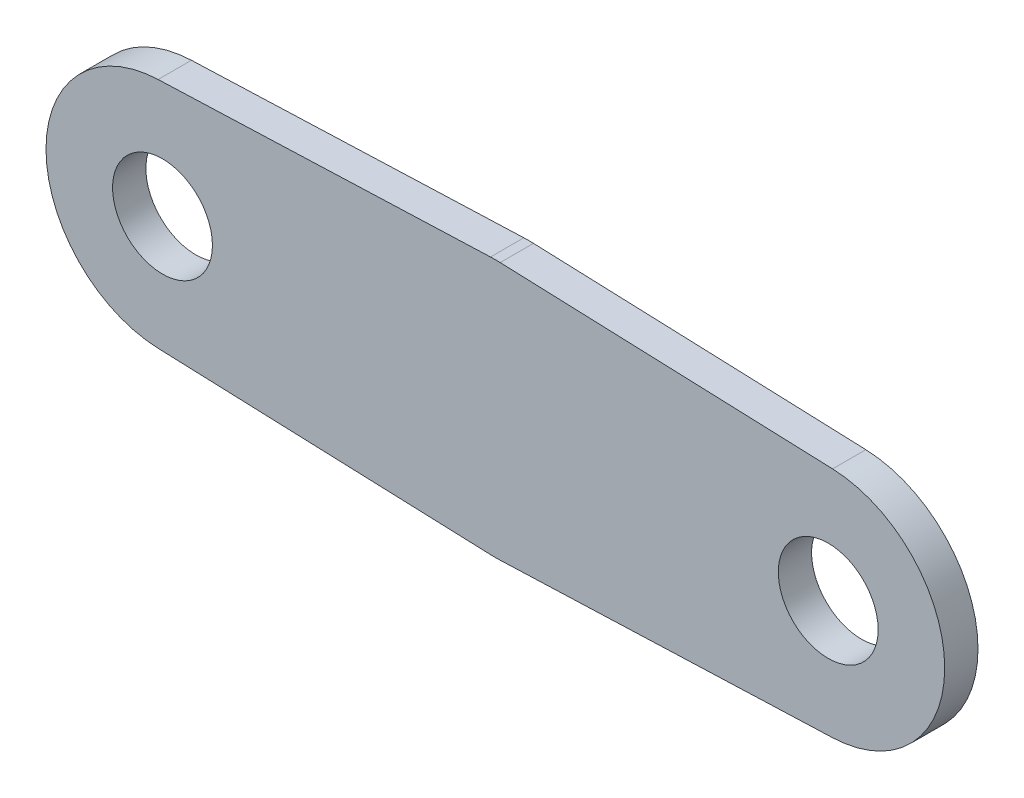
ISO-10303-21;
HEADER;
FILE_DESCRIPTION(('STEP AP214'),'2;1');
FILE_NAME('part.step','',(''),(''),'','','');
FILE_SCHEMA(('AUTOMOTIVE_DESIGN { 1 0 10303 214 1 1 1 1 }'));
ENDSEC;
DATA;
#1=APPLICATION_CONTEXT('core data for automotive mechanical design processes');
#2=APPLICATION_PROTOCOL_DEFINITION('international standard','automotive_design',2000,#1);
#3=PRODUCT_CONTEXT('',#1,'mechanical');
#4=PRODUCT('Part','Part','',(#3));
#5=PRODUCT_RELATED_PRODUCT_CATEGORY('part','',(#4));
#6=PRODUCT_DEFINITION_FORMATION('','',#4);
#7=PRODUCT_DEFINITION_CONTEXT('part definition',#1,'design');
#8=PRODUCT_DEFINITION('design','',#6,#7);
#9=PRODUCT_DEFINITION_SHAPE('','',#8);
#10=(LENGTH_UNIT() NAMED_UNIT(*) SI_UNIT(.MILLI.,.METRE.));
#11=(NAMED_UNIT(*) PLANE_ANGLE_UNIT() SI_UNIT($,.RADIAN.));
#12=(NAMED_UNIT(*) SI_UNIT($,.STERADIAN.) SOLID_ANGLE_UNIT());
#13=UNCERTAINTY_MEASURE_WITH_UNIT(LENGTH_MEASURE(1.E-05),#10,'distance_accuracy_value','');
#14=(GEOMETRIC_REPRESENTATION_CONTEXT(3) GLOBAL_UNCERTAINTY_ASSIGNED_CONTEXT((#13)) GLOBAL_UNIT_ASSIGNED_CONTEXT((#10,
#11,#12)) REPRESENTATION_CONTEXT('',''));
#15=CARTESIAN_POINT('',(0.,0.,0.));
#16=DIRECTION('',(0.,0.,1.));
#17=DIRECTION('',(1.,0.,0.));
#18=AXIS2_PLACEMENT_3D('',#15,#16,#17);
#19=CARTESIAN_POINT('',(0.,0.,2.));
#20=DIRECTION('',(0.,0.,1.));
#21=DIRECTION('',(1.,0.,0.));
#22=AXIS2_PLACEMENT_3D('',#19,#20,#21);
#23=PLANE('',#22);
#24=CARTESIAN_POINT('',(-20.,0.,2.));
#25=DIRECTION('',(0.,0.,1.));
#26=DIRECTION('',(1.,0.,0.));
#27=AXIS2_PLACEMENT_3D('',#24,#25,#26);
#28=CIRCLE('',#27,3.);
#29=CARTESIAN_POINT('',(-17.,0.,2.));
#30=VERTEX_POINT('',#29);
#31=EDGE_CURVE('E135',#30,#30,#28,.T.);
#32=ORIENTED_EDGE('',*,*,#31,.F.);
#33=EDGE_LOOP('',(#32));
#34=FACE_BOUND('',#33,.T.);
#35=CARTESIAN_POINT('',(0.,0.,2.));
#36=DIRECTION('',(0.,0.,1.));
#37=DIRECTION('',(1.,0.,0.));
#38=AXIS2_PLACEMENT_3D('',#35,#36,#37);
#39=CIRCLE('',#38,7.75);
#40=CARTESIAN_POINT('',(0.290624999999998,7.74454886416084,2.));
#41=VERTEX_POINT('',#40);
#42=CARTESIAN_POINT('',(-0.290625,7.74454886416085,2.));
#43=VERTEX_POINT('',#42);
#44=EDGE_CURVE('E146',#41,#43,#39,.T.);
#45=ORIENTED_EDGE('',*,*,#44,.T.);
#46=DIRECTION('',(-0.999296627633657,-0.0375,0.));
#47=VECTOR('',#46,1.);
#48=CARTESIAN_POINT('',(-0.290625,7.74454886416085,2.));
#49=LINE('',#48,#47);
#50=CARTESIAN_POINT('',(-20.2625,6.9950763934356,2.));
#51=VERTEX_POINT('',#50);
#52=EDGE_CURVE('E94',#43,#51,#49,.T.);
#53=ORIENTED_EDGE('',*,*,#52,.T.);
#54=CARTESIAN_POINT('',(-20.,0.,2.));
#55=DIRECTION('',(0.,0.,1.));
#56=DIRECTION('',(1.,0.,0.));
#57=AXIS2_PLACEMENT_3D('',#54,#55,#56);
#58=CIRCLE('',#57,7.);
#59=CARTESIAN_POINT('',(-20.2625,-6.9950763934356,2.));
#60=VERTEX_POINT('',#59);
#61=EDGE_CURVE('E161',#51,#60,#58,.T.);
#62=ORIENTED_EDGE('',*,*,#61,.T.);
#63=DIRECTION('',(0.999296627633657,-0.0375,0.));
#64=VECTOR('',#63,1.);
#65=CARTESIAN_POINT('',(-0.290625,-7.74454886416085,2.));
#66=LINE('',#65,#64);
#67=CARTESIAN_POINT('',(-0.290625,-7.74454886416085,2.));
#68=VERTEX_POINT('',#67);
#69=EDGE_CURVE('E174',#60,#68,#66,.T.);
#70=ORIENTED_EDGE('',*,*,#69,.T.);
#71=CARTESIAN_POINT('',(0.,0.,2.));
#72=DIRECTION('',(0.,0.,1.));
#73=DIRECTION('',(1.,0.,0.));
#74=AXIS2_PLACEMENT_3D('',#71,#72,#73);
#75=CIRCLE('',#74,7.75);
#76=CARTESIAN_POINT('',(0.290625000000003,-7.74454886416084,2.));
#77=VERTEX_POINT('',#76);
#78=EDGE_CURVE('E113',#68,#77,#75,.T.);
#79=ORIENTED_EDGE('',*,*,#78,.T.);
#80=DIRECTION('',(0.999296627633657,0.0375000000000003,0.));
#81=VECTOR('',#80,1.);
#82=CARTESIAN_POINT('',(0.290625000000002,-7.74454886416084,2.));
#83=LINE('',#82,#81);
#84=CARTESIAN_POINT('',(20.2625,-6.99507639343559,2.));
#85=VERTEX_POINT('',#84);
#86=EDGE_CURVE('E107',#77,#85,#83,.T.);
#87=ORIENTED_EDGE('',*,*,#86,.T.);
#88=CARTESIAN_POINT('',(20.,0.,2.));
#89=DIRECTION('',(0.,0.,1.));
#90=DIRECTION('',(1.,0.,0.));
#91=AXIS2_PLACEMENT_3D('',#88,#89,#90);
#92=CIRCLE('',#91,7.);
#93=CARTESIAN_POINT('',(20.2625,6.99507639343561,2.));
#94=VERTEX_POINT('',#93);
#95=EDGE_CURVE('E111',#85,#94,#92,.T.);
#96=ORIENTED_EDGE('',*,*,#95,.T.);
#97=DIRECTION('',(-0.999296627633657,0.0374999999999998,0.));
#98=VECTOR('',#97,1.);
#99=CARTESIAN_POINT('',(0.290624999999998,7.74454886416084,2.));
#100=LINE('',#99,#98);
#101=EDGE_CURVE('E51',#94,#41,#100,.T.);
#102=ORIENTED_EDGE('',*,*,#101,.T.);
#103=EDGE_LOOP('',(#45,#53,#62,#70,#79,#87,#96,#102));
#104=FACE_BOUND('',#103,.T.);
#105=CARTESIAN_POINT('',(20.,0.,2.));
#106=DIRECTION('',(0.,0.,1.));
#107=DIRECTION('',(1.,0.,0.));
#108=AXIS2_PLACEMENT_3D('',#105,#106,#107);
#109=CIRCLE('',#108,3.);
#110=CARTESIAN_POINT('',(23.,0.,2.));
#111=VERTEX_POINT('',#110);
#112=EDGE_CURVE('E183',#111,#111,#109,.T.);
#113=ORIENTED_EDGE('',*,*,#112,.F.);
#114=EDGE_LOOP('',(#113));
#115=FACE_BOUND('',#114,.T.);
#116=ADVANCED_FACE('F34',(#34,#104,#115),#23,.T.);
#117=CARTESIAN_POINT('',(0.,0.,0.));
#118=DIRECTION('',(0.,0.,1.));
#119=DIRECTION('',(1.,0.,0.));
#120=AXIS2_PLACEMENT_3D('',#117,#118,#119);
#121=PLANE('',#120);
#122=CARTESIAN_POINT('',(0.,0.,0.));
#123=DIRECTION('',(0.,0.,1.));
#124=DIRECTION('',(1.,0.,0.));
#125=AXIS2_PLACEMENT_3D('',#122,#123,#124);
#126=CIRCLE('',#125,7.75);
#127=CARTESIAN_POINT('',(0.290624999999998,7.74454886416084,0.));
#128=VERTEX_POINT('',#127);
#129=CARTESIAN_POINT('',(-0.290625,7.74454886416085,0.));
#130=VERTEX_POINT('',#129);
#131=EDGE_CURVE('E131',#128,#130,#126,.T.);
#132=ORIENTED_EDGE('',*,*,#131,.F.);
#133=DIRECTION('',(-0.999296627633657,0.0374999999999998,0.));
#134=VECTOR('',#133,1.);
#135=CARTESIAN_POINT('',(0.290624999999998,7.74454886416084,0.));
#136=LINE('',#135,#134);
#137=CARTESIAN_POINT('',(20.2625,6.99507639343561,0.));
#138=VERTEX_POINT('',#137);
#139=EDGE_CURVE('E86',#138,#128,#136,.T.);
#140=ORIENTED_EDGE('',*,*,#139,.F.);
#141=CARTESIAN_POINT('',(20.,0.,0.));
#142=DIRECTION('',(0.,0.,1.));
#143=DIRECTION('',(1.,0.,0.));
#144=AXIS2_PLACEMENT_3D('',#141,#142,#143);
#145=CIRCLE('',#144,7.);
#146=CARTESIAN_POINT('',(20.2625,-6.99507639343559,0.));
#147=VERTEX_POINT('',#146);
#148=EDGE_CURVE('E80',#147,#138,#145,.T.);
#149=ORIENTED_EDGE('',*,*,#148,.F.);
#150=DIRECTION('',(0.999296627633657,0.0375000000000003,0.));
#151=VECTOR('',#150,1.);
#152=CARTESIAN_POINT('',(0.290625000000002,-7.74454886416084,0.));
#153=LINE('',#152,#151);
#154=CARTESIAN_POINT('',(0.290625000000003,-7.74454886416084,0.));
#155=VERTEX_POINT('',#154);
#156=EDGE_CURVE('E121',#155,#147,#153,.T.);
#157=ORIENTED_EDGE('',*,*,#156,.F.);
#158=CARTESIAN_POINT('',(0.,0.,0.));
#159=DIRECTION('',(0.,0.,1.));
#160=DIRECTION('',(1.,0.,0.));
#161=AXIS2_PLACEMENT_3D('',#158,#159,#160);
#162=CIRCLE('',#161,7.75);
#163=CARTESIAN_POINT('',(-0.290625,-7.74454886416085,0.));
#164=VERTEX_POINT('',#163);
#165=EDGE_CURVE('E141',#164,#155,#162,.T.);
#166=ORIENTED_EDGE('',*,*,#165,.F.);
#167=DIRECTION('',(0.999296627633657,-0.0375,0.));
#168=VECTOR('',#167,1.);
#169=CARTESIAN_POINT('',(-0.290625,-7.74454886416085,0.));
#170=LINE('',#169,#168);
#171=CARTESIAN_POINT('',(-20.2625,-6.9950763934356,0.));
#172=VERTEX_POINT('',#171);
#173=EDGE_CURVE('E139',#172,#164,#170,.T.);
#174=ORIENTED_EDGE('',*,*,#173,.F.);
#175=CARTESIAN_POINT('',(-20.,0.,0.));
#176=DIRECTION('',(0.,0.,1.));
#177=DIRECTION('',(1.,0.,0.));
#178=AXIS2_PLACEMENT_3D('',#175,#176,#177);
#179=CIRCLE('',#178,7.);
#180=CARTESIAN_POINT('',(-20.2625,6.9950763934356,0.));
#181=VERTEX_POINT('',#180);
#182=EDGE_CURVE('E137',#181,#172,#179,.T.);
#183=ORIENTED_EDGE('',*,*,#182,.F.);
#184=DIRECTION('',(-0.999296627633657,-0.0375,0.));
#185=VECTOR('',#184,1.);
#186=CARTESIAN_POINT('',(-0.290625,7.74454886416085,0.));
#187=LINE('',#186,#185);
#188=EDGE_CURVE('E134',#130,#181,#187,.T.);
#189=ORIENTED_EDGE('',*,*,#188,.F.);
#190=EDGE_LOOP('',(#132,#140,#149,#157,#166,#174,#183,#189));
#191=FACE_BOUND('',#190,.T.);
#192=CARTESIAN_POINT('',(-20.,0.,0.));
#193=DIRECTION('',(0.,0.,1.));
#194=DIRECTION('',(1.,0.,0.));
#195=AXIS2_PLACEMENT_3D('',#192,#193,#194);
#196=CIRCLE('',#195,3.);
#197=CARTESIAN_POINT('',(-17.,0.,0.));
#198=VERTEX_POINT('',#197);
#199=EDGE_CURVE('E180',#198,#198,#196,.T.);
#200=ORIENTED_EDGE('',*,*,#199,.T.);
#201=EDGE_LOOP('',(#200));
#202=FACE_BOUND('',#201,.T.);
#203=CARTESIAN_POINT('',(20.,0.,0.));
#204=DIRECTION('',(0.,0.,1.));
#205=DIRECTION('',(1.,0.,0.));
#206=AXIS2_PLACEMENT_3D('',#203,#204,#205);
#207=CIRCLE('',#206,3.);
#208=CARTESIAN_POINT('',(23.,0.,0.));
#209=VERTEX_POINT('',#208);
#210=EDGE_CURVE('E186',#209,#209,#207,.T.);
#211=ORIENTED_EDGE('',*,*,#210,.T.);
#212=EDGE_LOOP('',(#211));
#213=FACE_BOUND('',#212,.T.);
#214=ADVANCED_FACE('F165',(#191,#202,#213),#121,.F.);
#215=CARTESIAN_POINT('',(0.,0.,2.));
#216=DIRECTION('',(0.,0.,-1.));
#217=DIRECTION('',(-1.,0.,0.));
#218=AXIS2_PLACEMENT_3D('',#215,#216,#217);
#219=CYLINDRICAL_SURFACE('',#218,7.75);
#220=ORIENTED_EDGE('',*,*,#131,.T.);
#221=DIRECTION('',(0.,0.,-1.));
#222=VECTOR('',#221,1.);
#223=CARTESIAN_POINT('',(-0.290625,7.74454886416085,2.));
#224=LINE('',#223,#222);
#225=EDGE_CURVE('E11',#43,#130,#224,.T.);
#226=ORIENTED_EDGE('',*,*,#225,.F.);
#227=ORIENTED_EDGE('',*,*,#44,.F.);
#228=DIRECTION('',(0.,0.,-1.));
#229=VECTOR('',#228,1.);
#230=CARTESIAN_POINT('',(0.290624999999998,7.74454886416084,2.));
#231=LINE('',#230,#229);
#232=EDGE_CURVE('E127',#41,#128,#231,.T.);
#233=ORIENTED_EDGE('',*,*,#232,.T.);
#234=EDGE_LOOP('',(#220,#226,#227,#233));
#235=FACE_BOUND('',#234,.T.);
#236=ADVANCED_FACE('F36',(#235),#219,.T.);
#237=CARTESIAN_POINT('',(-0.290625,7.74454886416085,2.));
#238=DIRECTION('',(0.0375,-0.999296627633657,0.));
#239=DIRECTION('',(0.999296627633657,0.0375,0.));
#240=AXIS2_PLACEMENT_3D('',#237,#238,#239);
#241=PLANE('',#240);
#242=ORIENTED_EDGE('',*,*,#188,.T.);
#243=DIRECTION('',(0.,0.,-1.));
#244=VECTOR('',#243,1.);
#245=CARTESIAN_POINT('',(-20.2625,6.9950763934356,2.));
#246=LINE('',#245,#244);
#247=EDGE_CURVE('E43',#51,#181,#246,.T.);
#248=ORIENTED_EDGE('',*,*,#247,.F.);
#249=ORIENTED_EDGE('',*,*,#52,.F.);
#250=ORIENTED_EDGE('',*,*,#225,.T.);
#251=EDGE_LOOP('',(#242,#248,#249,#250));
#252=FACE_BOUND('',#251,.T.);
#253=ADVANCED_FACE('F218',(#252),#241,.F.);
#254=CARTESIAN_POINT('',(-20.,0.,2.));
#255=DIRECTION('',(0.,0.,-1.));
#256=DIRECTION('',(-1.,0.,0.));
#257=AXIS2_PLACEMENT_3D('',#254,#255,#256);
#258=CYLINDRICAL_SURFACE('',#257,7.);
#259=ORIENTED_EDGE('',*,*,#182,.T.);
#260=DIRECTION('',(0.,0.,-1.));
#261=VECTOR('',#260,1.);
#262=CARTESIAN_POINT('',(-20.2625,-6.9950763934356,2.));
#263=LINE('',#262,#261);
#264=EDGE_CURVE('E153',#60,#172,#263,.T.);
#265=ORIENTED_EDGE('',*,*,#264,.F.);
#266=ORIENTED_EDGE('',*,*,#61,.F.);
#267=ORIENTED_EDGE('',*,*,#247,.T.);
#268=EDGE_LOOP('',(#259,#265,#266,#267));
#269=FACE_BOUND('',#268,.T.);
#270=ADVANCED_FACE('F159',(#269),#258,.T.);
#271=CARTESIAN_POINT('',(-0.290625,-7.74454886416085,2.));
#272=DIRECTION('',(0.0375,0.999296627633657,0.));
#273=DIRECTION('',(-0.999296627633657,0.0375,0.));
#274=AXIS2_PLACEMENT_3D('',#271,#272,#273);
#275=PLANE('',#274);
#276=ORIENTED_EDGE('',*,*,#173,.T.);
#277=DIRECTION('',(0.,0.,-1.));
#278=VECTOR('',#277,1.);
#279=CARTESIAN_POINT('',(-0.290625,-7.74454886416085,2.));
#280=LINE('',#279,#278);
#281=EDGE_CURVE('E150',#68,#164,#280,.T.);
#282=ORIENTED_EDGE('',*,*,#281,.F.);
#283=ORIENTED_EDGE('',*,*,#69,.F.);
#284=ORIENTED_EDGE('',*,*,#264,.T.);
#285=EDGE_LOOP('',(#276,#282,#283,#284));
#286=FACE_BOUND('',#285,.T.);
#287=ADVANCED_FACE('F170',(#286),#275,.F.);
#288=CARTESIAN_POINT('',(0.,0.,2.));
#289=DIRECTION('',(0.,0.,-1.));
#290=DIRECTION('',(-1.,0.,0.));
#291=AXIS2_PLACEMENT_3D('',#288,#289,#290);
#292=CYLINDRICAL_SURFACE('',#291,7.75);
#293=ORIENTED_EDGE('',*,*,#165,.T.);
#294=DIRECTION('',(0.,0.,-1.));
#295=VECTOR('',#294,1.);
#296=CARTESIAN_POINT('',(0.290625000000003,-7.74454886416084,2.));
#297=LINE('',#296,#295);
#298=EDGE_CURVE('E122',#77,#155,#297,.T.);
#299=ORIENTED_EDGE('',*,*,#298,.F.);
#300=ORIENTED_EDGE('',*,*,#78,.F.);
#301=ORIENTED_EDGE('',*,*,#281,.T.);
#302=EDGE_LOOP('',(#293,#299,#300,#301));
#303=FACE_BOUND('',#302,.T.);
#304=ADVANCED_FACE('F173',(#303),#292,.T.);
#305=CARTESIAN_POINT('',(0.290625000000002,-7.74454886416084,2.));
#306=DIRECTION('',(-0.0375000000000003,0.999296627633657,0.));
#307=DIRECTION('',(-0.999296627633657,-0.0375000000000003,0.));
#308=AXIS2_PLACEMENT_3D('',#305,#306,#307);
#309=PLANE('',#308);
#310=ORIENTED_EDGE('',*,*,#156,.T.);
#311=DIRECTION('',(0.,0.,-1.));
#312=VECTOR('',#311,1.);
#313=CARTESIAN_POINT('',(20.2625,-6.99507639343559,2.));
#314=LINE('',#313,#312);
#315=EDGE_CURVE('E118',#85,#147,#314,.T.);
#316=ORIENTED_EDGE('',*,*,#315,.F.);
#317=ORIENTED_EDGE('',*,*,#86,.F.);
#318=ORIENTED_EDGE('',*,*,#298,.T.);
#319=EDGE_LOOP('',(#310,#316,#317,#318));
#320=FACE_BOUND('',#319,.T.);
#321=ADVANCED_FACE('F119',(#320),#309,.F.);
#322=CARTESIAN_POINT('',(20.,0.,2.));
#323=DIRECTION('',(0.,0.,-1.));
#324=DIRECTION('',(-1.,0.,0.));
#325=AXIS2_PLACEMENT_3D('',#322,#323,#324);
#326=CYLINDRICAL_SURFACE('',#325,7.);
#327=ORIENTED_EDGE('',*,*,#148,.T.);
#328=DIRECTION('',(0.,0.,-1.));
#329=VECTOR('',#328,1.);
#330=CARTESIAN_POINT('',(20.2625,6.99507639343561,2.));
#331=LINE('',#330,#329);
#332=EDGE_CURVE('E123',#94,#138,#331,.T.);
#333=ORIENTED_EDGE('',*,*,#332,.F.);
#334=ORIENTED_EDGE('',*,*,#95,.F.);
#335=ORIENTED_EDGE('',*,*,#315,.T.);
#336=EDGE_LOOP('',(#327,#333,#334,#335));
#337=FACE_BOUND('',#336,.T.);
#338=ADVANCED_FACE('F125',(#337),#326,.T.);
#339=CARTESIAN_POINT('',(0.290624999999998,7.74454886416084,2.));
#340=DIRECTION('',(-0.0374999999999998,-0.999296627633657,0.));
#341=DIRECTION('',(0.999296627633657,-0.0374999999999998,0.));
#342=AXIS2_PLACEMENT_3D('',#339,#340,#341);
#343=PLANE('',#342);
#344=ORIENTED_EDGE('',*,*,#139,.T.);
#345=ORIENTED_EDGE('',*,*,#232,.F.);
#346=ORIENTED_EDGE('',*,*,#101,.F.);
#347=ORIENTED_EDGE('',*,*,#332,.T.);
#348=EDGE_LOOP('',(#344,#345,#346,#347));
#349=FACE_BOUND('',#348,.T.);
#350=ADVANCED_FACE('F206',(#349),#343,.F.);
#351=CARTESIAN_POINT('',(-20.,0.,2.));
#352=DIRECTION('',(0.,0.,-1.));
#353=DIRECTION('',(-1.,0.,0.));
#354=AXIS2_PLACEMENT_3D('',#351,#352,#353);
#355=CYLINDRICAL_SURFACE('',#354,3.);
#356=ORIENTED_EDGE('',*,*,#31,.T.);
#357=EDGE_LOOP('',(#356));
#358=FACE_BOUND('',#357,.T.);
#359=ORIENTED_EDGE('',*,*,#199,.F.);
#360=EDGE_LOOP('',(#359));
#361=FACE_BOUND('',#360,.T.);
#362=ADVANCED_FACE('F203',(#358,#361),#355,.F.);
#363=CARTESIAN_POINT('',(20.,0.,2.));
#364=DIRECTION('',(0.,0.,-1.));
#365=DIRECTION('',(-1.,0.,0.));
#366=AXIS2_PLACEMENT_3D('',#363,#364,#365);
#367=CYLINDRICAL_SURFACE('',#366,3.);
#368=ORIENTED_EDGE('',*,*,#112,.T.);
#369=EDGE_LOOP('',(#368));
#370=FACE_BOUND('',#369,.T.);
#371=ORIENTED_EDGE('',*,*,#210,.F.);
#372=EDGE_LOOP('',(#371));
#373=FACE_BOUND('',#372,.T.);
#374=ADVANCED_FACE('F192',(#370,#373),#367,.F.);
#375=CLOSED_SHELL('',(#116,#214,#236,#253,#270,#287,#304,#321,#338,#350,#362,#374));
#376=MANIFOLD_SOLID_BREP('B2',#375);
#377=ADVANCED_BREP_SHAPE_REPRESENTATION('',(#18,#376),#14);
#378=SHAPE_DEFINITION_REPRESENTATION(#9,#377);
ENDSEC;
END-ISO-10303-21;
